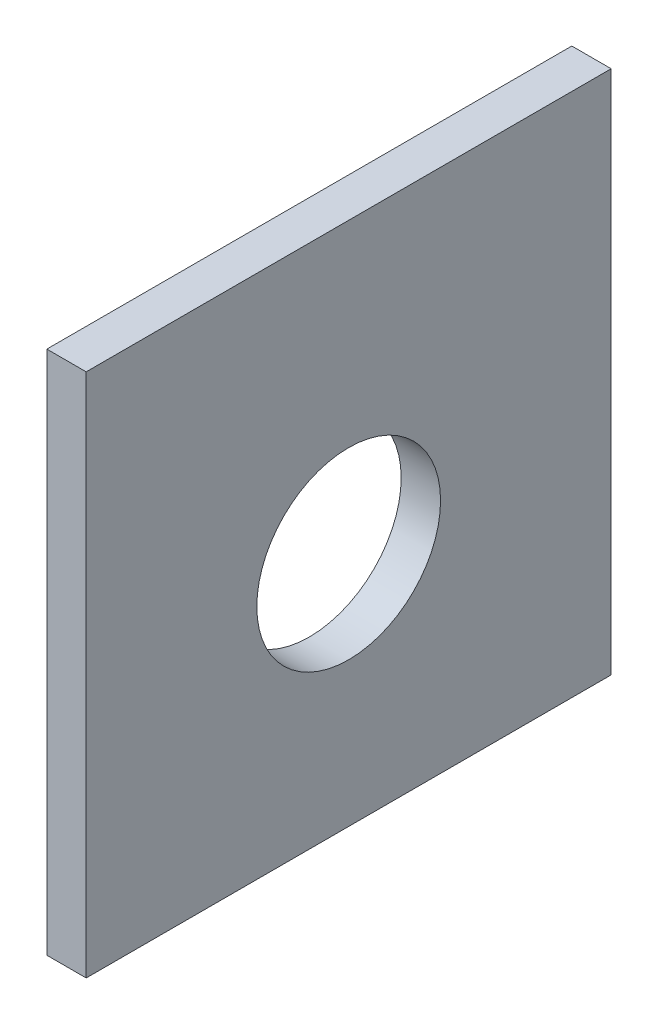
ISO-10303-21;
HEADER;
FILE_DESCRIPTION(('STEP AP214'),'2;1');
FILE_NAME('part.step','',(''),(''),'','','');
FILE_SCHEMA(('AUTOMOTIVE_DESIGN { 1 0 10303 214 1 1 1 1 }'));
ENDSEC;
DATA;
#1=APPLICATION_CONTEXT('core data for automotive mechanical design processes');
#2=APPLICATION_PROTOCOL_DEFINITION('international standard','automotive_design',2000,#1);
#3=PRODUCT_CONTEXT('',#1,'mechanical');
#4=PRODUCT('Part','Part','',(#3));
#5=PRODUCT_RELATED_PRODUCT_CATEGORY('part','',(#4));
#6=PRODUCT_DEFINITION_FORMATION('','',#4);
#7=PRODUCT_DEFINITION_CONTEXT('part definition',#1,'design');
#8=PRODUCT_DEFINITION('design','',#6,#7);
#9=PRODUCT_DEFINITION_SHAPE('','',#8);
#10=(LENGTH_UNIT() NAMED_UNIT(*) SI_UNIT(.MILLI.,.METRE.));
#11=(NAMED_UNIT(*) PLANE_ANGLE_UNIT() SI_UNIT($,.RADIAN.));
#12=(NAMED_UNIT(*) SI_UNIT($,.STERADIAN.) SOLID_ANGLE_UNIT());
#13=UNCERTAINTY_MEASURE_WITH_UNIT(LENGTH_MEASURE(1.E-05),#10,'distance_accuracy_value','');
#14=(GEOMETRIC_REPRESENTATION_CONTEXT(3) GLOBAL_UNCERTAINTY_ASSIGNED_CONTEXT((#13)) GLOBAL_UNIT_ASSIGNED_CONTEXT((#10,
#11,#12)) REPRESENTATION_CONTEXT('',''));
#15=CARTESIAN_POINT('',(0.,0.,0.));
#16=DIRECTION('',(0.,0.,1.));
#17=DIRECTION('',(1.,0.,0.));
#18=AXIS2_PLACEMENT_3D('',#15,#16,#17);
#19=CARTESIAN_POINT('',(3.,0.,0.));
#20=DIRECTION('',(-1.,0.,0.));
#21=DIRECTION('',(0.,0.,1.));
#22=AXIS2_PLACEMENT_3D('',#19,#20,#21);
#23=PLANE('',#22);
#24=DIRECTION('',(0.,-1.,0.));
#25=VECTOR('',#24,1.);
#26=CARTESIAN_POINT('',(3.,-32.1973012921568,31.2692457590579));
#27=LINE('',#26,#25);
#28=CARTESIAN_POINT('',(3.,7.80269870784321,31.2692457590579));
#29=VERTEX_POINT('',#28);
#30=CARTESIAN_POINT('',(3.,-32.1973012921568,31.2692457590579));
#31=VERTEX_POINT('',#30);
#32=EDGE_CURVE('E85',#29,#31,#27,.T.);
#33=ORIENTED_EDGE('',*,*,#32,.T.);
#34=DIRECTION('',(0.,0.,-1.));
#35=VECTOR('',#34,1.);
#36=CARTESIAN_POINT('',(3.,-32.1973012921568,-8.73075424094205));
#37=LINE('',#36,#35);
#38=CARTESIAN_POINT('',(3.,-32.1973012921568,-8.73075424094205));
#39=VERTEX_POINT('',#38);
#40=EDGE_CURVE('E80',#31,#39,#37,.T.);
#41=ORIENTED_EDGE('',*,*,#40,.T.);
#42=DIRECTION('',(0.,1.,0.));
#43=VECTOR('',#42,1.);
#44=CARTESIAN_POINT('',(3.,7.80269870784321,-8.73075424094205));
#45=LINE('',#44,#43);
#46=CARTESIAN_POINT('',(3.,7.80269870784321,-8.73075424094205));
#47=VERTEX_POINT('',#46);
#48=EDGE_CURVE('E83',#39,#47,#45,.T.);
#49=ORIENTED_EDGE('',*,*,#48,.T.);
#50=DIRECTION('',(0.,0.,1.));
#51=VECTOR('',#50,1.);
#52=CARTESIAN_POINT('',(3.,7.80269870784321,31.2692457590579));
#53=LINE('',#52,#51);
#54=EDGE_CURVE('E50',#47,#29,#53,.T.);
#55=ORIENTED_EDGE('',*,*,#54,.T.);
#56=EDGE_LOOP('',(#33,#41,#49,#55));
#57=FACE_BOUND('',#56,.T.);
#58=CARTESIAN_POINT('',(3.,-14.1973012921568,11.269245759058));
#59=DIRECTION('',(1.,0.,0.));
#60=DIRECTION('',(0.,0.,-1.));
#61=AXIS2_PLACEMENT_3D('',#58,#59,#60);
#62=CIRCLE('',#61,6.99999999999999);
#63=CARTESIAN_POINT('',(3.,-14.1973012921568,4.26924575905798));
#64=VERTEX_POINT('',#63);
#65=EDGE_CURVE('E100',#64,#64,#62,.T.);
#66=ORIENTED_EDGE('',*,*,#65,.F.);
#67=EDGE_LOOP('',(#66));
#68=FACE_BOUND('',#67,.T.);
#69=ADVANCED_FACE('F33',(#57,#68),#23,.F.);
#70=CARTESIAN_POINT('',(0.,0.,0.));
#71=DIRECTION('',(-1.,0.,0.));
#72=DIRECTION('',(0.,0.,1.));
#73=AXIS2_PLACEMENT_3D('',#70,#71,#72);
#74=PLANE('',#73);
#75=DIRECTION('',(0.,-1.,0.));
#76=VECTOR('',#75,1.);
#77=CARTESIAN_POINT('',(0.,-32.1973012921568,31.2692457590579));
#78=LINE('',#77,#76);
#79=CARTESIAN_POINT('',(0.,7.80269870784321,31.2692457590579));
#80=VERTEX_POINT('',#79);
#81=CARTESIAN_POINT('',(0.,-32.1973012921568,31.2692457590579));
#82=VERTEX_POINT('',#81);
#83=EDGE_CURVE('E97',#80,#82,#78,.T.);
#84=ORIENTED_EDGE('',*,*,#83,.F.);
#85=DIRECTION('',(0.,0.,1.));
#86=VECTOR('',#85,1.);
#87=CARTESIAN_POINT('',(0.,7.80269870784321,31.2692457590579));
#88=LINE('',#87,#86);
#89=CARTESIAN_POINT('',(0.,7.80269870784321,-8.73075424094205));
#90=VERTEX_POINT('',#89);
#91=EDGE_CURVE('E73',#90,#80,#88,.T.);
#92=ORIENTED_EDGE('',*,*,#91,.F.);
#93=DIRECTION('',(0.,1.,0.));
#94=VECTOR('',#93,1.);
#95=CARTESIAN_POINT('',(0.,7.80269870784321,-8.73075424094205));
#96=LINE('',#95,#94);
#97=CARTESIAN_POINT('',(0.,-32.1973012921568,-8.73075424094205));
#98=VERTEX_POINT('',#97);
#99=EDGE_CURVE('E67',#98,#90,#96,.T.);
#100=ORIENTED_EDGE('',*,*,#99,.F.);
#101=DIRECTION('',(0.,0.,-1.));
#102=VECTOR('',#101,1.);
#103=CARTESIAN_POINT('',(0.,-32.1973012921568,-8.73075424094205));
#104=LINE('',#103,#102);
#105=EDGE_CURVE('E89',#82,#98,#104,.T.);
#106=ORIENTED_EDGE('',*,*,#105,.F.);
#107=EDGE_LOOP('',(#84,#92,#100,#106));
#108=FACE_BOUND('',#107,.T.);
#109=CARTESIAN_POINT('',(0.,-14.1973012921568,11.269245759058));
#110=DIRECTION('',(1.,0.,0.));
#111=DIRECTION('',(0.,0.,-1.));
#112=AXIS2_PLACEMENT_3D('',#109,#110,#111);
#113=CIRCLE('',#112,6.99999999999999);
#114=CARTESIAN_POINT('',(0.,-14.1973012921568,4.26924575905798));
#115=VERTEX_POINT('',#114);
#116=EDGE_CURVE('E112',#115,#115,#113,.T.);
#117=ORIENTED_EDGE('',*,*,#116,.T.);
#118=EDGE_LOOP('',(#117));
#119=FACE_BOUND('',#118,.T.);
#120=ADVANCED_FACE('F108',(#108,#119),#74,.T.);
#121=CARTESIAN_POINT('',(3.,-32.1973012921568,31.2692457590579));
#122=DIRECTION('',(0.,0.,-1.));
#123=DIRECTION('',(-1.,0.,0.));
#124=AXIS2_PLACEMENT_3D('',#121,#122,#123);
#125=PLANE('',#124);
#126=ORIENTED_EDGE('',*,*,#83,.T.);
#127=DIRECTION('',(-1.,0.,0.));
#128=VECTOR('',#127,1.);
#129=CARTESIAN_POINT('',(3.,-32.1973012921568,31.2692457590579));
#130=LINE('',#129,#128);
#131=EDGE_CURVE('E11',#31,#82,#130,.T.);
#132=ORIENTED_EDGE('',*,*,#131,.F.);
#133=ORIENTED_EDGE('',*,*,#32,.F.);
#134=DIRECTION('',(-1.,0.,0.));
#135=VECTOR('',#134,1.);
#136=CARTESIAN_POINT('',(3.,7.80269870784321,31.2692457590579));
#137=LINE('',#136,#135);
#138=EDGE_CURVE('E93',#29,#80,#137,.T.);
#139=ORIENTED_EDGE('',*,*,#138,.T.);
#140=EDGE_LOOP('',(#126,#132,#133,#139));
#141=FACE_BOUND('',#140,.T.);
#142=ADVANCED_FACE('F35',(#141),#125,.F.);
#143=CARTESIAN_POINT('',(3.,-32.1973012921568,-8.73075424094205));
#144=DIRECTION('',(0.,1.,0.));
#145=DIRECTION('',(0.,0.,1.));
#146=AXIS2_PLACEMENT_3D('',#143,#144,#145);
#147=PLANE('',#146);
#148=ORIENTED_EDGE('',*,*,#105,.T.);
#149=DIRECTION('',(-1.,0.,0.));
#150=VECTOR('',#149,1.);
#151=CARTESIAN_POINT('',(3.,-32.1973012921568,-8.73075424094205));
#152=LINE('',#151,#150);
#153=EDGE_CURVE('E42',#39,#98,#152,.T.);
#154=ORIENTED_EDGE('',*,*,#153,.F.);
#155=ORIENTED_EDGE('',*,*,#40,.F.);
#156=ORIENTED_EDGE('',*,*,#131,.T.);
#157=EDGE_LOOP('',(#148,#154,#155,#156));
#158=FACE_BOUND('',#157,.T.);
#159=ADVANCED_FACE('F88',(#158),#147,.F.);
#160=CARTESIAN_POINT('',(3.,7.80269870784321,-8.73075424094205));
#161=DIRECTION('',(0.,0.,1.));
#162=DIRECTION('',(1.,0.,0.));
#163=AXIS2_PLACEMENT_3D('',#160,#161,#162);
#164=PLANE('',#163);
#165=ORIENTED_EDGE('',*,*,#99,.T.);
#166=DIRECTION('',(-1.,0.,0.));
#167=VECTOR('',#166,1.);
#168=CARTESIAN_POINT('',(3.,7.80269870784321,-8.73075424094205));
#169=LINE('',#168,#167);
#170=EDGE_CURVE('E90',#47,#90,#169,.T.);
#171=ORIENTED_EDGE('',*,*,#170,.F.);
#172=ORIENTED_EDGE('',*,*,#48,.F.);
#173=ORIENTED_EDGE('',*,*,#153,.T.);
#174=EDGE_LOOP('',(#165,#171,#172,#173));
#175=FACE_BOUND('',#174,.T.);
#176=ADVANCED_FACE('F91',(#175),#164,.F.);
#177=CARTESIAN_POINT('',(3.,7.80269870784321,31.2692457590579));
#178=DIRECTION('',(0.,-1.,0.));
#179=DIRECTION('',(0.,0.,-1.));
#180=AXIS2_PLACEMENT_3D('',#177,#178,#179);
#181=PLANE('',#180);
#182=ORIENTED_EDGE('',*,*,#91,.T.);
#183=ORIENTED_EDGE('',*,*,#138,.F.);
#184=ORIENTED_EDGE('',*,*,#54,.F.);
#185=ORIENTED_EDGE('',*,*,#170,.T.);
#186=EDGE_LOOP('',(#182,#183,#184,#185));
#187=FACE_BOUND('',#186,.T.);
#188=ADVANCED_FACE('F105',(#187),#181,.F.);
#189=CARTESIAN_POINT('',(3.,-14.1973012921568,11.269245759058));
#190=DIRECTION('',(-1.,0.,0.));
#191=DIRECTION('',(0.,0.,1.));
#192=AXIS2_PLACEMENT_3D('',#189,#190,#191);
#193=CYLINDRICAL_SURFACE('',#192,6.99999999999999);
#194=ORIENTED_EDGE('',*,*,#65,.T.);
#195=EDGE_LOOP('',(#194));
#196=FACE_BOUND('',#195,.T.);
#197=ORIENTED_EDGE('',*,*,#116,.F.);
#198=EDGE_LOOP('',(#197));
#199=FACE_BOUND('',#198,.T.);
#200=ADVANCED_FACE('F118',(#196,#199),#193,.F.);
#201=CLOSED_SHELL('',(#69,#120,#142,#159,#176,#188,#200));
#202=MANIFOLD_SOLID_BREP('B2',#201);
#203=ADVANCED_BREP_SHAPE_REPRESENTATION('',(#18,#202),#14);
#204=SHAPE_DEFINITION_REPRESENTATION(#9,#203);
ENDSEC;
END-ISO-10303-21;
